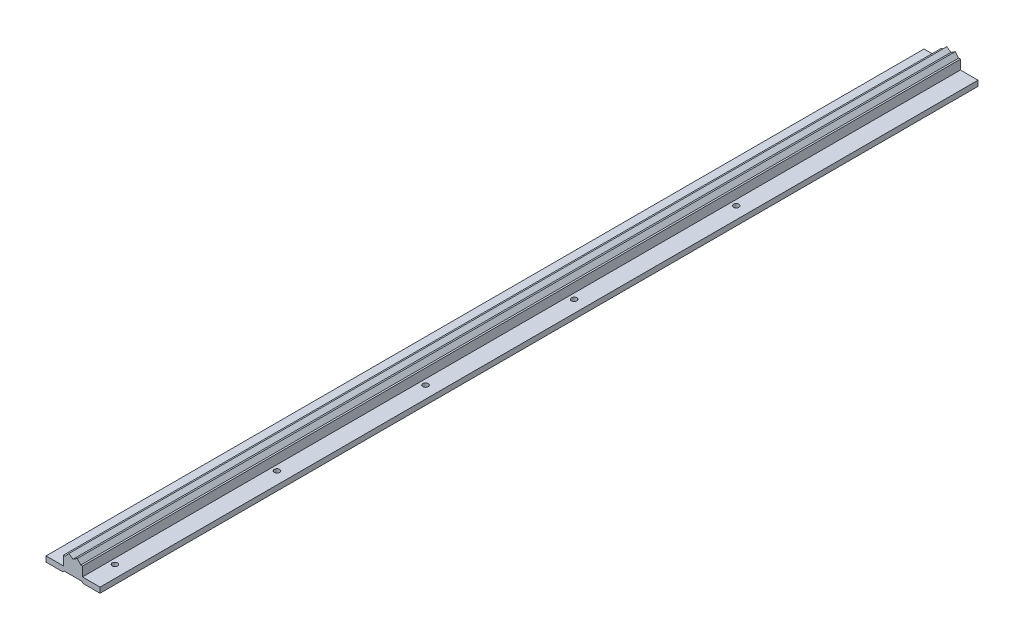
ISO-10303-21;
HEADER;
FILE_DESCRIPTION(('STEP AP214'),'2;1');
FILE_NAME('part.step','',(''),(''),'','','');
FILE_SCHEMA(('AUTOMOTIVE_DESIGN { 1 0 10303 214 1 1 1 1 }'));
ENDSEC;
DATA;
#1=APPLICATION_CONTEXT('core data for automotive mechanical design processes');
#2=APPLICATION_PROTOCOL_DEFINITION('international standard','automotive_design',2000,#1);
#3=PRODUCT_CONTEXT('',#1,'mechanical');
#4=PRODUCT('Part','Part','',(#3));
#5=PRODUCT_RELATED_PRODUCT_CATEGORY('part','',(#4));
#6=PRODUCT_DEFINITION_FORMATION('','',#4);
#7=PRODUCT_DEFINITION_CONTEXT('part definition',#1,'design');
#8=PRODUCT_DEFINITION('design','',#6,#7);
#9=PRODUCT_DEFINITION_SHAPE('','',#8);
#10=(LENGTH_UNIT() NAMED_UNIT(*) SI_UNIT(.MILLI.,.METRE.));
#11=(NAMED_UNIT(*) PLANE_ANGLE_UNIT() SI_UNIT($,.RADIAN.));
#12=(NAMED_UNIT(*) SI_UNIT($,.STERADIAN.) SOLID_ANGLE_UNIT());
#13=UNCERTAINTY_MEASURE_WITH_UNIT(LENGTH_MEASURE(1.E-05),#10,'distance_accuracy_value','');
#14=(GEOMETRIC_REPRESENTATION_CONTEXT(3) GLOBAL_UNCERTAINTY_ASSIGNED_CONTEXT((#13)) GLOBAL_UNIT_ASSIGNED_CONTEXT((#10,
#11,#12)) REPRESENTATION_CONTEXT('',''));
#15=CARTESIAN_POINT('',(0.,0.,0.));
#16=DIRECTION('',(0.,0.,1.));
#17=DIRECTION('',(1.,0.,0.));
#18=AXIS2_PLACEMENT_3D('',#15,#16,#17);
#19=CARTESIAN_POINT('',(11.,-19.0020156909,360.));
#20=DIRECTION('',(0.,1.,0.));
#21=DIRECTION('',(0.,0.,1.));
#22=AXIS2_PLACEMENT_3D('',#19,#20,#21);
#23=CYLINDRICAL_SURFACE('',#22,2.);
#24=CARTESIAN_POINT('',(11.,-15.0020156909,360.));
#25=DIRECTION('',(0.,1.,0.));
#26=DIRECTION('',(0.,0.,1.));
#27=AXIS2_PLACEMENT_3D('',#24,#25,#26);
#28=CIRCLE('',#27,2.);
#29=CARTESIAN_POINT('',(11.,-15.0020156909,362.));
#30=VERTEX_POINT('',#29);
#31=EDGE_CURVE('E20',#30,#30,#28,.T.);
#32=ORIENTED_EDGE('',*,*,#31,.T.);
#33=EDGE_LOOP('',(#32));
#34=FACE_BOUND('',#33,.T.);
#35=CARTESIAN_POINT('',(11.,-19.0020156909,360.));
#36=DIRECTION('',(0.,1.,0.));
#37=DIRECTION('',(0.,0.,1.));
#38=AXIS2_PLACEMENT_3D('',#35,#36,#37);
#39=CIRCLE('',#38,2.);
#40=CARTESIAN_POINT('',(11.,-19.0020156909,362.));
#41=VERTEX_POINT('',#40);
#42=EDGE_CURVE('E202',#41,#41,#39,.F.);
#43=ORIENTED_EDGE('',*,*,#42,.T.);
#44=EDGE_LOOP('',(#43));
#45=FACE_BOUND('',#44,.T.);
#46=ADVANCED_FACE('F17',(#34,#45),#23,.F.);
#47=CARTESIAN_POINT('',(11.,-19.0020156909,250.));
#48=DIRECTION('',(0.,1.,0.));
#49=DIRECTION('',(0.,0.,1.));
#50=AXIS2_PLACEMENT_3D('',#47,#48,#49);
#51=CYLINDRICAL_SURFACE('',#50,2.);
#52=CARTESIAN_POINT('',(11.,-15.0020156909,250.));
#53=DIRECTION('',(0.,1.,0.));
#54=DIRECTION('',(0.,0.,1.));
#55=AXIS2_PLACEMENT_3D('',#52,#53,#54);
#56=CIRCLE('',#55,2.);
#57=CARTESIAN_POINT('',(11.,-15.0020156909,252.));
#58=VERTEX_POINT('',#57);
#59=EDGE_CURVE('E254',#58,#58,#56,.T.);
#60=ORIENTED_EDGE('',*,*,#59,.T.);
#61=EDGE_LOOP('',(#60));
#62=FACE_BOUND('',#61,.T.);
#63=CARTESIAN_POINT('',(11.,-19.0020156909,250.));
#64=DIRECTION('',(0.,1.,0.));
#65=DIRECTION('',(0.,0.,1.));
#66=AXIS2_PLACEMENT_3D('',#63,#64,#65);
#67=CIRCLE('',#66,2.);
#68=CARTESIAN_POINT('',(11.,-19.0020156909,252.));
#69=VERTEX_POINT('',#68);
#70=EDGE_CURVE('E242',#69,#69,#67,.F.);
#71=ORIENTED_EDGE('',*,*,#70,.T.);
#72=EDGE_LOOP('',(#71));
#73=FACE_BOUND('',#72,.T.);
#74=ADVANCED_FACE('F355',(#62,#73),#51,.F.);
#75=CARTESIAN_POINT('',(11.,-19.0020156909,480.));
#76=DIRECTION('',(0.,1.,0.));
#77=DIRECTION('',(0.,0.,1.));
#78=AXIS2_PLACEMENT_3D('',#75,#76,#77);
#79=CYLINDRICAL_SURFACE('',#78,2.);
#80=CARTESIAN_POINT('',(11.,-15.0020156909,480.));
#81=DIRECTION('',(0.,1.,0.));
#82=DIRECTION('',(0.,0.,1.));
#83=AXIS2_PLACEMENT_3D('',#80,#81,#82);
#84=CIRCLE('',#83,2.);
#85=CARTESIAN_POINT('',(11.,-15.0020156909,482.));
#86=VERTEX_POINT('',#85);
#87=EDGE_CURVE('E252',#86,#86,#84,.T.);
#88=ORIENTED_EDGE('',*,*,#87,.T.);
#89=EDGE_LOOP('',(#88));
#90=FACE_BOUND('',#89,.T.);
#91=CARTESIAN_POINT('',(11.,-19.0020156909,480.));
#92=DIRECTION('',(0.,1.,0.));
#93=DIRECTION('',(0.,0.,1.));
#94=AXIS2_PLACEMENT_3D('',#91,#92,#93);
#95=CIRCLE('',#94,2.);
#96=CARTESIAN_POINT('',(11.,-19.0020156909,482.));
#97=VERTEX_POINT('',#96);
#98=EDGE_CURVE('E239',#97,#97,#95,.F.);
#99=ORIENTED_EDGE('',*,*,#98,.T.);
#100=EDGE_LOOP('',(#99));
#101=FACE_BOUND('',#100,.T.);
#102=ADVANCED_FACE('F359',(#90,#101),#79,.F.);
#103=CARTESIAN_POINT('',(11.,-19.0020156909,140.));
#104=DIRECTION('',(0.,1.,0.));
#105=DIRECTION('',(0.,0.,1.));
#106=AXIS2_PLACEMENT_3D('',#103,#104,#105);
#107=CYLINDRICAL_SURFACE('',#106,2.);
#108=CARTESIAN_POINT('',(11.,-15.0020156909,140.));
#109=DIRECTION('',(0.,1.,0.));
#110=DIRECTION('',(0.,0.,1.));
#111=AXIS2_PLACEMENT_3D('',#108,#109,#110);
#112=CIRCLE('',#111,2.);
#113=CARTESIAN_POINT('',(11.,-15.0020156909,142.));
#114=VERTEX_POINT('',#113);
#115=EDGE_CURVE('E249',#114,#114,#112,.T.);
#116=ORIENTED_EDGE('',*,*,#115,.T.);
#117=EDGE_LOOP('',(#116));
#118=FACE_BOUND('',#117,.T.);
#119=CARTESIAN_POINT('',(11.,-19.0020156909,140.));
#120=DIRECTION('',(0.,1.,0.));
#121=DIRECTION('',(0.,0.,1.));
#122=AXIS2_PLACEMENT_3D('',#119,#120,#121);
#123=CIRCLE('',#122,2.);
#124=CARTESIAN_POINT('',(11.,-19.0020156909,142.));
#125=VERTEX_POINT('',#124);
#126=EDGE_CURVE('E236',#125,#125,#123,.F.);
#127=ORIENTED_EDGE('',*,*,#126,.T.);
#128=EDGE_LOOP('',(#127));
#129=FACE_BOUND('',#128,.T.);
#130=ADVANCED_FACE('F363',(#118,#129),#107,.F.);
#131=CARTESIAN_POINT('',(11.,-19.0020156909,20.));
#132=DIRECTION('',(0.,1.,0.));
#133=DIRECTION('',(0.,0.,1.));
#134=AXIS2_PLACEMENT_3D('',#131,#132,#133);
#135=CYLINDRICAL_SURFACE('',#134,2.);
#136=CARTESIAN_POINT('',(11.,-15.0020156909,20.));
#137=DIRECTION('',(0.,1.,0.));
#138=DIRECTION('',(0.,0.,1.));
#139=AXIS2_PLACEMENT_3D('',#136,#137,#138);
#140=CIRCLE('',#139,2.);
#141=CARTESIAN_POINT('',(11.,-15.0020156909,22.));
#142=VERTEX_POINT('',#141);
#143=EDGE_CURVE('E203',#142,#142,#140,.T.);
#144=ORIENTED_EDGE('',*,*,#143,.T.);
#145=EDGE_LOOP('',(#144));
#146=FACE_BOUND('',#145,.T.);
#147=CARTESIAN_POINT('',(11.,-19.0020156909,20.));
#148=DIRECTION('',(0.,1.,0.));
#149=DIRECTION('',(0.,0.,1.));
#150=AXIS2_PLACEMENT_3D('',#147,#148,#149);
#151=CIRCLE('',#150,2.);
#152=CARTESIAN_POINT('',(11.,-19.0020156909,22.));
#153=VERTEX_POINT('',#152);
#154=EDGE_CURVE('E198',#153,#153,#151,.F.);
#155=ORIENTED_EDGE('',*,*,#154,.T.);
#156=EDGE_LOOP('',(#155));
#157=FACE_BOUND('',#156,.T.);
#158=ADVANCED_FACE('F370',(#146,#157),#135,.F.);
#159=CARTESIAN_POINT('',(-6.999999999999,-8.002015690898,500.));
#160=DIRECTION('',(0.,-1.,0.));
#161=DIRECTION('',(0.,0.,-1.));
#162=AXIS2_PLACEMENT_3D('',#159,#160,#161);
#163=PLANE('',#162);
#164=DIRECTION('',(1.,0.,0.));
#165=VECTOR('',#164,1.);
#166=CARTESIAN_POINT('',(-6.999999999999,-8.002015690898,-150.));
#167=LINE('',#166,#165);
#168=CARTESIAN_POINT('',(-6.999999999999,-8.002015690898,-150.));
#169=VERTEX_POINT('',#168);
#170=CARTESIAN_POINT('',(-5.72008182559,-8.002015690898,-150.));
#171=VERTEX_POINT('',#170);
#172=EDGE_CURVE('E153',#169,#171,#167,.T.);
#173=ORIENTED_EDGE('',*,*,#172,.F.);
#174=DIRECTION('',(0.,0.,-1.));
#175=VECTOR('',#174,1.);
#176=CARTESIAN_POINT('',(-6.999999999999,-8.002015690898,500.));
#177=LINE('',#176,#175);
#178=CARTESIAN_POINT('',(-6.999999999999,-8.002015690898,500.));
#179=VERTEX_POINT('',#178);
#180=EDGE_CURVE('E184',#169,#179,#177,.F.);
#181=ORIENTED_EDGE('',*,*,#180,.T.);
#182=DIRECTION('',(1.,0.,0.));
#183=VECTOR('',#182,1.);
#184=CARTESIAN_POINT('',(-6.999999999999,-8.002015690898,500.));
#185=LINE('',#184,#183);
#186=CARTESIAN_POINT('',(-5.72008182559,-8.002015690898,500.));
#187=VERTEX_POINT('',#186);
#188=EDGE_CURVE('E206',#187,#179,#185,.F.);
#189=ORIENTED_EDGE('',*,*,#188,.F.);
#190=DIRECTION('',(0.,0.,1.));
#191=VECTOR('',#190,1.);
#192=CARTESIAN_POINT('',(-5.72008182559,-8.002015690898,500.));
#193=LINE('',#192,#191);
#194=EDGE_CURVE('E181',#187,#171,#193,.F.);
#195=ORIENTED_EDGE('',*,*,#194,.T.);
#196=EDGE_LOOP('',(#173,#181,#189,#195));
#197=FACE_BOUND('',#196,.T.);
#198=ADVANCED_FACE('F374',(#197),#163,.F.);
#199=CARTESIAN_POINT('',(7.,-8.002015690899,500.));
#200=DIRECTION('',(0.,-1.,0.));
#201=DIRECTION('',(0.,0.,-1.));
#202=AXIS2_PLACEMENT_3D('',#199,#200,#201);
#203=PLANE('',#202);
#204=DIRECTION('',(1.,0.,0.));
#205=VECTOR('',#204,1.);
#206=CARTESIAN_POINT('',(7.,-8.002015690899,-150.));
#207=LINE('',#206,#205);
#208=CARTESIAN_POINT('',(5.720081825592,-8.002015690899,-150.));
#209=VERTEX_POINT('',#208);
#210=CARTESIAN_POINT('',(7.,-8.002015690899,-150.));
#211=VERTEX_POINT('',#210);
#212=EDGE_CURVE('E152',#209,#211,#207,.T.);
#213=ORIENTED_EDGE('',*,*,#212,.F.);
#214=DIRECTION('',(0.,0.,1.));
#215=VECTOR('',#214,1.);
#216=CARTESIAN_POINT('',(5.720081825592,-8.002015690899,500.));
#217=LINE('',#216,#215);
#218=CARTESIAN_POINT('',(5.720081825592,-8.002015690899,500.));
#219=VERTEX_POINT('',#218);
#220=EDGE_CURVE('E156',#209,#219,#217,.T.);
#221=ORIENTED_EDGE('',*,*,#220,.T.);
#222=DIRECTION('',(1.,0.,0.));
#223=VECTOR('',#222,1.);
#224=CARTESIAN_POINT('',(7.,-8.002015690899,500.));
#225=LINE('',#224,#223);
#226=CARTESIAN_POINT('',(7.,-8.002015690899,500.));
#227=VERTEX_POINT('',#226);
#228=EDGE_CURVE('E139',#227,#219,#225,.F.);
#229=ORIENTED_EDGE('',*,*,#228,.F.);
#230=DIRECTION('',(0.,0.,1.));
#231=VECTOR('',#230,1.);
#232=CARTESIAN_POINT('',(7.,-8.002015690899,500.));
#233=LINE('',#232,#231);
#234=EDGE_CURVE('E159',#227,#211,#233,.F.);
#235=ORIENTED_EDGE('',*,*,#234,.T.);
#236=EDGE_LOOP('',(#213,#221,#229,#235));
#237=FACE_BOUND('',#236,.T.);
#238=ADVANCED_FACE('F157',(#237),#203,.F.);
#239=CARTESIAN_POINT('',(-11.,-19.0020156909,360.));
#240=DIRECTION('',(0.,1.,0.));
#241=DIRECTION('',(0.,0.,1.));
#242=AXIS2_PLACEMENT_3D('',#239,#240,#241);
#243=CYLINDRICAL_SURFACE('',#242,2.);
#244=CARTESIAN_POINT('',(-11.,-15.0020156909,360.));
#245=DIRECTION('',(0.,1.,0.));
#246=DIRECTION('',(0.,0.,1.));
#247=AXIS2_PLACEMENT_3D('',#244,#245,#246);
#248=CIRCLE('',#247,2.);
#249=CARTESIAN_POINT('',(-11.,-15.0020156909,362.));
#250=VERTEX_POINT('',#249);
#251=EDGE_CURVE('E197',#250,#250,#248,.T.);
#252=ORIENTED_EDGE('',*,*,#251,.T.);
#253=EDGE_LOOP('',(#252));
#254=FACE_BOUND('',#253,.T.);
#255=CARTESIAN_POINT('',(-11.,-19.0020156909,360.));
#256=DIRECTION('',(0.,1.,0.));
#257=DIRECTION('',(0.,0.,1.));
#258=AXIS2_PLACEMENT_3D('',#255,#256,#257);
#259=CIRCLE('',#258,2.);
#260=CARTESIAN_POINT('',(-11.,-19.0020156909,362.));
#261=VERTEX_POINT('',#260);
#262=EDGE_CURVE('E172',#261,#261,#259,.F.);
#263=ORIENTED_EDGE('',*,*,#262,.T.);
#264=EDGE_LOOP('',(#263));
#265=FACE_BOUND('',#264,.T.);
#266=ADVANCED_FACE('F381',(#254,#265),#243,.F.);
#267=CARTESIAN_POINT('',(-11.,-19.0020156909,250.));
#268=DIRECTION('',(0.,1.,0.));
#269=DIRECTION('',(0.,0.,1.));
#270=AXIS2_PLACEMENT_3D('',#267,#268,#269);
#271=CYLINDRICAL_SURFACE('',#270,2.);
#272=CARTESIAN_POINT('',(-11.,-15.0020156909,250.));
#273=DIRECTION('',(0.,1.,0.));
#274=DIRECTION('',(0.,0.,1.));
#275=AXIS2_PLACEMENT_3D('',#272,#273,#274);
#276=CIRCLE('',#275,2.);
#277=CARTESIAN_POINT('',(-11.,-15.0020156909,252.));
#278=VERTEX_POINT('',#277);
#279=EDGE_CURVE('E229',#278,#278,#276,.T.);
#280=ORIENTED_EDGE('',*,*,#279,.T.);
#281=EDGE_LOOP('',(#280));
#282=FACE_BOUND('',#281,.T.);
#283=CARTESIAN_POINT('',(-11.,-19.0020156909,250.));
#284=DIRECTION('',(0.,1.,0.));
#285=DIRECTION('',(0.,0.,1.));
#286=AXIS2_PLACEMENT_3D('',#283,#284,#285);
#287=CIRCLE('',#286,2.);
#288=CARTESIAN_POINT('',(-11.,-19.0020156909,252.));
#289=VERTEX_POINT('',#288);
#290=EDGE_CURVE('E216',#289,#289,#287,.F.);
#291=ORIENTED_EDGE('',*,*,#290,.T.);
#292=EDGE_LOOP('',(#291));
#293=FACE_BOUND('',#292,.T.);
#294=ADVANCED_FACE('F384',(#282,#293),#271,.F.);
#295=CARTESIAN_POINT('',(-11.,-19.0020156909,140.));
#296=DIRECTION('',(0.,1.,0.));
#297=DIRECTION('',(0.,0.,1.));
#298=AXIS2_PLACEMENT_3D('',#295,#296,#297);
#299=CYLINDRICAL_SURFACE('',#298,2.);
#300=CARTESIAN_POINT('',(-11.,-15.0020156909,140.));
#301=DIRECTION('',(0.,1.,0.));
#302=DIRECTION('',(0.,0.,1.));
#303=AXIS2_PLACEMENT_3D('',#300,#301,#302);
#304=CIRCLE('',#303,2.);
#305=CARTESIAN_POINT('',(-11.,-15.0020156909,142.));
#306=VERTEX_POINT('',#305);
#307=EDGE_CURVE('E226',#306,#306,#304,.T.);
#308=ORIENTED_EDGE('',*,*,#307,.T.);
#309=EDGE_LOOP('',(#308));
#310=FACE_BOUND('',#309,.T.);
#311=CARTESIAN_POINT('',(-11.,-19.0020156909,140.));
#312=DIRECTION('',(0.,1.,0.));
#313=DIRECTION('',(0.,0.,1.));
#314=AXIS2_PLACEMENT_3D('',#311,#312,#313);
#315=CIRCLE('',#314,2.);
#316=CARTESIAN_POINT('',(-11.,-19.0020156909,142.));
#317=VERTEX_POINT('',#316);
#318=EDGE_CURVE('E213',#317,#317,#315,.F.);
#319=ORIENTED_EDGE('',*,*,#318,.T.);
#320=EDGE_LOOP('',(#319));
#321=FACE_BOUND('',#320,.T.);
#322=ADVANCED_FACE('F388',(#310,#321),#299,.F.);
#323=CARTESIAN_POINT('',(-11.,-19.0020156909,20.));
#324=DIRECTION('',(0.,1.,0.));
#325=DIRECTION('',(0.,0.,1.));
#326=AXIS2_PLACEMENT_3D('',#323,#324,#325);
#327=CYLINDRICAL_SURFACE('',#326,2.);
#328=CARTESIAN_POINT('',(-11.,-15.0020156909,20.));
#329=DIRECTION('',(0.,1.,0.));
#330=DIRECTION('',(0.,0.,1.));
#331=AXIS2_PLACEMENT_3D('',#328,#329,#330);
#332=CIRCLE('',#331,2.);
#333=CARTESIAN_POINT('',(-11.,-15.0020156909,22.));
#334=VERTEX_POINT('',#333);
#335=EDGE_CURVE('E223',#334,#334,#332,.T.);
#336=ORIENTED_EDGE('',*,*,#335,.T.);
#337=EDGE_LOOP('',(#336));
#338=FACE_BOUND('',#337,.T.);
#339=CARTESIAN_POINT('',(-11.,-19.0020156909,20.));
#340=DIRECTION('',(0.,1.,0.));
#341=DIRECTION('',(0.,0.,1.));
#342=AXIS2_PLACEMENT_3D('',#339,#340,#341);
#343=CIRCLE('',#342,2.);
#344=CARTESIAN_POINT('',(-11.,-19.0020156909,22.));
#345=VERTEX_POINT('',#344);
#346=EDGE_CURVE('E210',#345,#345,#343,.F.);
#347=ORIENTED_EDGE('',*,*,#346,.T.);
#348=EDGE_LOOP('',(#347));
#349=FACE_BOUND('',#348,.T.);
#350=ADVANCED_FACE('F277',(#338,#349),#327,.F.);
#351=CARTESIAN_POINT('',(-11.,-19.0020156909,480.));
#352=DIRECTION('',(0.,1.,0.));
#353=DIRECTION('',(0.,0.,1.));
#354=AXIS2_PLACEMENT_3D('',#351,#352,#353);
#355=CYLINDRICAL_SURFACE('',#354,2.);
#356=CARTESIAN_POINT('',(-11.,-15.0020156909,480.));
#357=DIRECTION('',(0.,1.,0.));
#358=DIRECTION('',(0.,0.,1.));
#359=AXIS2_PLACEMENT_3D('',#356,#357,#358);
#360=CIRCLE('',#359,2.);
#361=CARTESIAN_POINT('',(-11.,-15.0020156909,482.));
#362=VERTEX_POINT('',#361);
#363=EDGE_CURVE('E193',#362,#362,#360,.T.);
#364=ORIENTED_EDGE('',*,*,#363,.T.);
#365=EDGE_LOOP('',(#364));
#366=FACE_BOUND('',#365,.T.);
#367=CARTESIAN_POINT('',(-11.,-19.0020156909,480.));
#368=DIRECTION('',(0.,1.,0.));
#369=DIRECTION('',(0.,0.,1.));
#370=AXIS2_PLACEMENT_3D('',#367,#368,#369);
#371=CIRCLE('',#370,2.);
#372=CARTESIAN_POINT('',(-11.,-19.0020156909,482.));
#373=VERTEX_POINT('',#372);
#374=EDGE_CURVE('E166',#373,#373,#371,.F.);
#375=ORIENTED_EDGE('',*,*,#374,.T.);
#376=EDGE_LOOP('',(#375));
#377=FACE_BOUND('',#376,.T.);
#378=ADVANCED_FACE('F266',(#366,#377),#355,.F.);
#379=CARTESIAN_POINT('',(20.,-15.0020156909,500.));
#380=DIRECTION('',(0.,-1.,0.));
#381=DIRECTION('',(0.,0.,-1.));
#382=AXIS2_PLACEMENT_3D('',#379,#380,#381);
#383=PLANE('',#382);
#384=DIRECTION('',(-1.,0.,0.));
#385=VECTOR('',#384,1.);
#386=CARTESIAN_POINT('',(0.,-15.0020156909,-150.));
#387=LINE('',#386,#385);
#388=CARTESIAN_POINT('',(7.,-15.0020156909,-150.));
#389=VERTEX_POINT('',#388);
#390=CARTESIAN_POINT('',(20.,-15.0020156909,-150.));
#391=VERTEX_POINT('',#390);
#392=EDGE_CURVE('E619',#389,#391,#387,.F.);
#393=ORIENTED_EDGE('',*,*,#392,.F.);
#394=DIRECTION('',(0.,0.,1.));
#395=VECTOR('',#394,1.);
#396=CARTESIAN_POINT('',(7.,-15.0020156909,500.));
#397=LINE('',#396,#395);
#398=CARTESIAN_POINT('',(7.,-15.0020156909,500.));
#399=VERTEX_POINT('',#398);
#400=EDGE_CURVE('E170',#389,#399,#397,.T.);
#401=ORIENTED_EDGE('',*,*,#400,.T.);
#402=DIRECTION('',(-1.,0.,0.));
#403=VECTOR('',#402,1.);
#404=CARTESIAN_POINT('',(-6.999999999999,-15.0020156909,500.));
#405=LINE('',#404,#403);
#406=CARTESIAN_POINT('',(20.,-15.0020156909,500.));
#407=VERTEX_POINT('',#406);
#408=EDGE_CURVE('E164',#399,#407,#405,.F.);
#409=ORIENTED_EDGE('',*,*,#408,.T.);
#410=DIRECTION('',(0.,0.,1.));
#411=VECTOR('',#410,1.);
#412=CARTESIAN_POINT('',(20.,-15.0020156909,500.));
#413=LINE('',#412,#411);
#414=EDGE_CURVE('E199',#407,#391,#413,.F.);
#415=ORIENTED_EDGE('',*,*,#414,.T.);
#416=EDGE_LOOP('',(#393,#401,#409,#415));
#417=FACE_BOUND('',#416,.T.);
#418=ORIENTED_EDGE('',*,*,#143,.F.);
#419=EDGE_LOOP('',(#418));
#420=FACE_BOUND('',#419,.T.);
#421=ORIENTED_EDGE('',*,*,#115,.F.);
#422=EDGE_LOOP('',(#421));
#423=FACE_BOUND('',#422,.T.);
#424=ORIENTED_EDGE('',*,*,#87,.F.);
#425=EDGE_LOOP('',(#424));
#426=FACE_BOUND('',#425,.T.);
#427=ORIENTED_EDGE('',*,*,#59,.F.);
#428=EDGE_LOOP('',(#427));
#429=FACE_BOUND('',#428,.T.);
#430=ORIENTED_EDGE('',*,*,#31,.F.);
#431=EDGE_LOOP('',(#430));
#432=FACE_BOUND('',#431,.T.);
#433=ADVANCED_FACE('F263',(#417,#420,#423,#426,#429,#432),#383,.F.);
#434=CARTESIAN_POINT('',(20.,-19.0020156909,500.));
#435=DIRECTION('',(-1.,0.,0.));
#436=DIRECTION('',(0.,0.,1.));
#437=AXIS2_PLACEMENT_3D('',#434,#435,#436);
#438=PLANE('',#437);
#439=DIRECTION('',(0.,1.,0.));
#440=VECTOR('',#439,1.);
#441=CARTESIAN_POINT('',(20.,0.,-150.));
#442=LINE('',#441,#440);
#443=CARTESIAN_POINT('',(20.,-19.0020156909,-150.));
#444=VERTEX_POINT('',#443);
#445=EDGE_CURVE('E617',#391,#444,#442,.F.);
#446=ORIENTED_EDGE('',*,*,#445,.F.);
#447=ORIENTED_EDGE('',*,*,#414,.F.);
#448=DIRECTION('',(0.,1.,0.));
#449=VECTOR('',#448,1.);
#450=CARTESIAN_POINT('',(20.,-8.002015690899,500.));
#451=LINE('',#450,#449);
#452=CARTESIAN_POINT('',(20.,-19.0020156909,500.));
#453=VERTEX_POINT('',#452);
#454=EDGE_CURVE('E646',#407,#453,#451,.F.);
#455=ORIENTED_EDGE('',*,*,#454,.T.);
#456=DIRECTION('',(0.,0.,1.));
#457=VECTOR('',#456,1.);
#458=CARTESIAN_POINT('',(20.,-19.0020156909,500.));
#459=LINE('',#458,#457);
#460=EDGE_CURVE('E194',#453,#444,#459,.F.);
#461=ORIENTED_EDGE('',*,*,#460,.T.);
#462=EDGE_LOOP('',(#446,#447,#455,#461));
#463=FACE_BOUND('',#462,.T.);
#464=ADVANCED_FACE('F265',(#463),#438,.F.);
#465=CARTESIAN_POINT('',(20.,-19.0020156909,500.));
#466=DIRECTION('',(0.,1.,0.));
#467=DIRECTION('',(0.,0.,1.));
#468=AXIS2_PLACEMENT_3D('',#465,#466,#467);
#469=PLANE('',#468);
#470=DIRECTION('',(-1.,0.,0.));
#471=VECTOR('',#470,1.);
#472=CARTESIAN_POINT('',(0.,-19.0020156909,-150.));
#473=LINE('',#472,#471);
#474=CARTESIAN_POINT('',(7.500000000001,-19.0020156909,-150.));
#475=VERTEX_POINT('',#474);
#476=EDGE_CURVE('E344',#444,#475,#473,.T.);
#477=ORIENTED_EDGE('',*,*,#476,.F.);
#478=ORIENTED_EDGE('',*,*,#460,.F.);
#479=DIRECTION('',(-1.,0.,0.));
#480=VECTOR('',#479,1.);
#481=CARTESIAN_POINT('',(-6.999999999999,-19.0020156909,500.));
#482=LINE('',#481,#480);
#483=CARTESIAN_POINT('',(7.500000000001,-19.0020156909,500.));
#484=VERTEX_POINT('',#483);
#485=EDGE_CURVE('E644',#453,#484,#482,.T.);
#486=ORIENTED_EDGE('',*,*,#485,.T.);
#487=DIRECTION('',(0.,0.,1.));
#488=VECTOR('',#487,1.);
#489=CARTESIAN_POINT('',(7.500000000001,-19.0020156909,500.));
#490=LINE('',#489,#488);
#491=EDGE_CURVE('E621',#484,#475,#490,.F.);
#492=ORIENTED_EDGE('',*,*,#491,.T.);
#493=EDGE_LOOP('',(#477,#478,#486,#492));
#494=FACE_BOUND('',#493,.T.);
#495=ORIENTED_EDGE('',*,*,#154,.F.);
#496=EDGE_LOOP('',(#495));
#497=FACE_BOUND('',#496,.T.);
#498=ORIENTED_EDGE('',*,*,#126,.F.);
#499=EDGE_LOOP('',(#498));
#500=FACE_BOUND('',#499,.T.);
#501=ORIENTED_EDGE('',*,*,#98,.F.);
#502=EDGE_LOOP('',(#501));
#503=FACE_BOUND('',#502,.T.);
#504=ORIENTED_EDGE('',*,*,#70,.F.);
#505=EDGE_LOOP('',(#504));
#506=FACE_BOUND('',#505,.T.);
#507=ORIENTED_EDGE('',*,*,#42,.F.);
#508=EDGE_LOOP('',(#507));
#509=FACE_BOUND('',#508,.T.);
#510=ADVANCED_FACE('F274',(#494,#497,#500,#503,#506,#509),#469,.F.);
#511=CARTESIAN_POINT('',(-20.,-19.0020156909,500.));
#512=DIRECTION('',(1.,0.,0.));
#513=DIRECTION('',(0.,0.,-1.));
#514=AXIS2_PLACEMENT_3D('',#511,#512,#513);
#515=PLANE('',#514);
#516=DIRECTION('',(0.,1.,0.));
#517=VECTOR('',#516,1.);
#518=CARTESIAN_POINT('',(-20.,0.,-150.));
#519=LINE('',#518,#517);
#520=CARTESIAN_POINT('',(-20.,-19.0020156909,-150.));
#521=VERTEX_POINT('',#520);
#522=CARTESIAN_POINT('',(-20.,-15.0020156909,-150.));
#523=VERTEX_POINT('',#522);
#524=EDGE_CURVE('E606',#521,#523,#519,.T.);
#525=ORIENTED_EDGE('',*,*,#524,.F.);
#526=DIRECTION('',(0.,0.,1.));
#527=VECTOR('',#526,1.);
#528=CARTESIAN_POINT('',(-20.,-19.0020156909,500.));
#529=LINE('',#528,#527);
#530=CARTESIAN_POINT('',(-20.,-19.0020156909,500.));
#531=VERTEX_POINT('',#530);
#532=EDGE_CURVE('E162',#521,#531,#529,.T.);
#533=ORIENTED_EDGE('',*,*,#532,.T.);
#534=DIRECTION('',(0.,1.,0.));
#535=VECTOR('',#534,1.);
#536=CARTESIAN_POINT('',(-20.,-8.002015690899,500.));
#537=LINE('',#536,#535);
#538=CARTESIAN_POINT('',(-20.,-15.0020156909,500.));
#539=VERTEX_POINT('',#538);
#540=EDGE_CURVE('E638',#531,#539,#537,.T.);
#541=ORIENTED_EDGE('',*,*,#540,.T.);
#542=DIRECTION('',(0.,0.,-1.));
#543=VECTOR('',#542,1.);
#544=CARTESIAN_POINT('',(-20.,-15.0020156909,500.));
#545=LINE('',#544,#543);
#546=EDGE_CURVE('E190',#539,#523,#545,.T.);
#547=ORIENTED_EDGE('',*,*,#546,.T.);
#548=EDGE_LOOP('',(#525,#533,#541,#547));
#549=FACE_BOUND('',#548,.T.);
#550=ADVANCED_FACE('F332',(#549),#515,.F.);
#551=CARTESIAN_POINT('',(-6.999999999999,-15.0020156909,500.));
#552=DIRECTION('',(0.,-1.,0.));
#553=DIRECTION('',(0.,0.,-1.));
#554=AXIS2_PLACEMENT_3D('',#551,#552,#553);
#555=PLANE('',#554);
#556=DIRECTION('',(-1.,0.,0.));
#557=VECTOR('',#556,1.);
#558=CARTESIAN_POINT('',(0.,-15.0020156909,-150.));
#559=LINE('',#558,#557);
#560=CARTESIAN_POINT('',(-6.999999999999,-15.0020156909,-150.));
#561=VERTEX_POINT('',#560);
#562=EDGE_CURVE('E601',#523,#561,#559,.F.);
#563=ORIENTED_EDGE('',*,*,#562,.F.);
#564=ORIENTED_EDGE('',*,*,#546,.F.);
#565=DIRECTION('',(-1.,0.,0.));
#566=VECTOR('',#565,1.);
#567=CARTESIAN_POINT('',(-6.999999999999,-15.0020156909,500.));
#568=LINE('',#567,#566);
#569=CARTESIAN_POINT('',(-6.999999999999,-15.0020156909,500.));
#570=VERTEX_POINT('',#569);
#571=EDGE_CURVE('E635',#539,#570,#568,.F.);
#572=ORIENTED_EDGE('',*,*,#571,.T.);
#573=DIRECTION('',(0.,0.,-1.));
#574=VECTOR('',#573,1.);
#575=CARTESIAN_POINT('',(-6.999999999999,-15.0020156909,500.));
#576=LINE('',#575,#574);
#577=EDGE_CURVE('E187',#570,#561,#576,.T.);
#578=ORIENTED_EDGE('',*,*,#577,.T.);
#579=EDGE_LOOP('',(#563,#564,#572,#578));
#580=FACE_BOUND('',#579,.T.);
#581=ORIENTED_EDGE('',*,*,#363,.F.);
#582=EDGE_LOOP('',(#581));
#583=FACE_BOUND('',#582,.T.);
#584=ORIENTED_EDGE('',*,*,#335,.F.);
#585=EDGE_LOOP('',(#584));
#586=FACE_BOUND('',#585,.T.);
#587=ORIENTED_EDGE('',*,*,#307,.F.);
#588=EDGE_LOOP('',(#587));
#589=FACE_BOUND('',#588,.T.);
#590=ORIENTED_EDGE('',*,*,#279,.F.);
#591=EDGE_LOOP('',(#590));
#592=FACE_BOUND('',#591,.T.);
#593=ORIENTED_EDGE('',*,*,#251,.F.);
#594=EDGE_LOOP('',(#593));
#595=FACE_BOUND('',#594,.T.);
#596=ADVANCED_FACE('F328',(#580,#583,#586,#589,#592,#595),#555,.F.);
#597=CARTESIAN_POINT('',(-6.999999999999,-15.0020156909,500.));
#598=DIRECTION('',(1.,0.,0.));
#599=DIRECTION('',(0.,0.,-1.));
#600=AXIS2_PLACEMENT_3D('',#597,#598,#599);
#601=PLANE('',#600);
#602=DIRECTION('',(0.,1.,0.));
#603=VECTOR('',#602,1.);
#604=CARTESIAN_POINT('',(-6.999999999999,0.,-150.));
#605=LINE('',#604,#603);
#606=EDGE_CURVE('E597',#561,#169,#605,.T.);
#607=ORIENTED_EDGE('',*,*,#606,.F.);
#608=ORIENTED_EDGE('',*,*,#577,.F.);
#609=DIRECTION('',(0.,1.,0.));
#610=VECTOR('',#609,1.);
#611=CARTESIAN_POINT('',(-6.999999999999,-8.002015690899,500.));
#612=LINE('',#611,#610);
#613=EDGE_CURVE('E599',#570,#179,#612,.T.);
#614=ORIENTED_EDGE('',*,*,#613,.T.);
#615=ORIENTED_EDGE('',*,*,#180,.F.);
#616=EDGE_LOOP('',(#607,#608,#614,#615));
#617=FACE_BOUND('',#616,.T.);
#618=ADVANCED_FACE('F324',(#617),#601,.F.);
#619=CARTESIAN_POINT('',(-5.72008182559,-8.002015690898,500.));
#620=DIRECTION('',(0.748746223848007,-0.662856766031206,0.));
#621=DIRECTION('',(0.662856766031206,0.748746223848007,0.));
#622=AXIS2_PLACEMENT_3D('',#619,#620,#621);
#623=PLANE('',#622);
#624=DIRECTION('',(0.662856766031186,0.748746223848026,0.));
#625=VECTOR('',#624,1.);
#626=CARTESIAN_POINT('',(-5.72008182559,-8.002015690898,-150.));
#627=LINE('',#626,#625);
#628=CARTESIAN_POINT('',(-3.15440581759688,-5.1038930178741,-150.));
#629=VERTEX_POINT('',#628);
#630=EDGE_CURVE('E602',#171,#629,#627,.T.);
#631=ORIENTED_EDGE('',*,*,#630,.F.);
#632=ORIENTED_EDGE('',*,*,#194,.F.);
#633=DIRECTION('',(0.662856766031186,0.748746223848026,0.));
#634=VECTOR('',#633,1.);
#635=CARTESIAN_POINT('',(-5.72008182559,-8.002015690898,500.));
#636=LINE('',#635,#634);
#637=CARTESIAN_POINT('',(-3.15440581759688,-5.1038930178741,500.));
#638=VERTEX_POINT('',#637);
#639=EDGE_CURVE('E631',#187,#638,#636,.T.);
#640=ORIENTED_EDGE('',*,*,#639,.T.);
#641=DIRECTION('',(0.,0.,1.));
#642=VECTOR('',#641,1.);
#643=CARTESIAN_POINT('',(-3.15440581759691,-5.10389301787406,500.));
#644=LINE('',#643,#642);
#645=EDGE_CURVE('E178',#638,#629,#644,.F.);
#646=ORIENTED_EDGE('',*,*,#645,.T.);
#647=EDGE_LOOP('',(#631,#632,#640,#646));
#648=FACE_BOUND('',#647,.T.);
#649=ADVANCED_FACE('F320',(#648),#623,.F.);
#650=CARTESIAN_POINT('',(-3.154405817597,-5.103893017874,500.));
#651=DIRECTION('',(-0.540812375972124,-0.841143254146038,0.));
#652=DIRECTION('',(0.841143254146038,-0.540812375972124,0.));
#653=AXIS2_PLACEMENT_3D('',#650,#651,#652);
#654=PLANE('',#653);
#655=DIRECTION('',(0.841143254145996,-0.54081237597219,0.));
#656=VECTOR('',#655,1.);
#657=CARTESIAN_POINT('',(-3.15440581759692,-5.10389301787407,-150.));
#658=LINE('',#657,#656);
#659=CARTESIAN_POINT('',(4.48383358062232E-13,-7.13201569089868,-150.));
#660=VERTEX_POINT('',#659);
#661=EDGE_CURVE('E604',#629,#660,#658,.T.);
#662=ORIENTED_EDGE('',*,*,#661,.F.);
#663=ORIENTED_EDGE('',*,*,#645,.F.);
#664=DIRECTION('',(0.841143254145987,-0.540812375972203,0.));
#665=VECTOR('',#664,1.);
#666=CARTESIAN_POINT('',(-3.15440581759692,-5.10389301787407,500.));
#667=LINE('',#666,#665);
#668=CARTESIAN_POINT('',(4.22066751898029E-13,-7.13201569089868,500.));
#669=VERTEX_POINT('',#668);
#670=EDGE_CURVE('E628',#638,#669,#667,.T.);
#671=ORIENTED_EDGE('',*,*,#670,.T.);
#672=DIRECTION('',(0.,0.,1.));
#673=VECTOR('',#672,1.);
#674=CARTESIAN_POINT('',(2.96475470597113E-13,-7.13201569089883,500.));
#675=LINE('',#674,#673);
#676=EDGE_CURVE('E175',#669,#660,#675,.F.);
#677=ORIENTED_EDGE('',*,*,#676,.T.);
#678=EDGE_LOOP('',(#662,#663,#671,#677));
#679=FACE_BOUND('',#678,.T.);
#680=ADVANCED_FACE('F316',(#679),#654,.F.);
#681=CARTESIAN_POINT('',(0.,-7.132015690899,500.));
#682=DIRECTION('',(0.540812375972124,-0.841143254146038,0.));
#683=DIRECTION('',(0.841143254146038,0.540812375972124,0.));
#684=AXIS2_PLACEMENT_3D('',#681,#682,#683);
#685=PLANE('',#684);
#686=DIRECTION('',(0.841143254145984,0.540812375972207,0.));
#687=VECTOR('',#686,1.);
#688=CARTESIAN_POINT('',(3.87652781505947E-13,-7.1320156908988,-150.));
#689=LINE('',#688,#687);
#690=CARTESIAN_POINT('',(3.15440581759722,-5.10389301787449,-150.));
#691=VERTEX_POINT('',#690);
#692=EDGE_CURVE('E660',#660,#691,#689,.T.);
#693=ORIENTED_EDGE('',*,*,#692,.F.);
#694=ORIENTED_EDGE('',*,*,#676,.F.);
#695=DIRECTION('',(0.841143254145992,0.540812375972195,0.));
#696=VECTOR('',#695,1.);
#697=CARTESIAN_POINT('',(2.81892564846231E-13,-7.1320156908988,500.));
#698=LINE('',#697,#696);
#699=CARTESIAN_POINT('',(3.15440581759715,-5.10389301787444,500.));
#700=VERTEX_POINT('',#699);
#701=EDGE_CURVE('E626',#669,#700,#698,.T.);
#702=ORIENTED_EDGE('',*,*,#701,.T.);
#703=DIRECTION('',(0.,0.,1.));
#704=VECTOR('',#703,1.);
#705=CARTESIAN_POINT('',(3.15440581759707,-5.1038930178744,500.));
#706=LINE('',#705,#704);
#707=EDGE_CURVE('E134',#700,#691,#706,.F.);
#708=ORIENTED_EDGE('',*,*,#707,.T.);
#709=EDGE_LOOP('',(#693,#694,#702,#708));
#710=FACE_BOUND('',#709,.T.);
#711=ADVANCED_FACE('F313',(#710),#685,.F.);
#712=CARTESIAN_POINT('',(5.720081825592,-8.002015690899,500.));
#713=DIRECTION('',(-0.748746223847864,-0.662856766031368,0.));
#714=DIRECTION('',(0.662856766031368,-0.748746223847864,0.));
#715=AXIS2_PLACEMENT_3D('',#712,#713,#714);
#716=PLANE('',#715);
#717=DIRECTION('',(0.662856766031347,-0.748746223847883,0.));
#718=VECTOR('',#717,1.);
#719=CARTESIAN_POINT('',(3.15440581759715,-5.10389301787433,-150.));
#720=LINE('',#719,#718);
#721=EDGE_CURVE('E656',#691,#209,#720,.T.);
#722=ORIENTED_EDGE('',*,*,#721,.F.);
#723=ORIENTED_EDGE('',*,*,#707,.F.);
#724=DIRECTION('',(0.662856766031347,-0.748746223847883,0.));
#725=VECTOR('',#724,1.);
#726=CARTESIAN_POINT('',(3.15440581759715,-5.10389301787433,500.));
#727=LINE('',#726,#725);
#728=EDGE_CURVE('E144',#700,#219,#727,.T.);
#729=ORIENTED_EDGE('',*,*,#728,.T.);
#730=ORIENTED_EDGE('',*,*,#220,.F.);
#731=EDGE_LOOP('',(#722,#723,#729,#730));
#732=FACE_BOUND('',#731,.T.);
#733=ADVANCED_FACE('F161',(#732),#716,.F.);
#734=CARTESIAN_POINT('',(7.,-15.0020156909,500.));
#735=DIRECTION('',(-1.,0.,0.));
#736=DIRECTION('',(0.,0.,1.));
#737=AXIS2_PLACEMENT_3D('',#734,#735,#736);
#738=PLANE('',#737);
#739=DIRECTION('',(0.,1.,0.));
#740=VECTOR('',#739,1.);
#741=CARTESIAN_POINT('',(7.,0.,-150.));
#742=LINE('',#741,#740);
#743=EDGE_CURVE('E654',#211,#389,#742,.F.);
#744=ORIENTED_EDGE('',*,*,#743,.F.);
#745=ORIENTED_EDGE('',*,*,#234,.F.);
#746=DIRECTION('',(0.,1.,0.));
#747=VECTOR('',#746,1.);
#748=CARTESIAN_POINT('',(7.,-8.002015690899,500.));
#749=LINE('',#748,#747);
#750=EDGE_CURVE('E148',#227,#399,#749,.F.);
#751=ORIENTED_EDGE('',*,*,#750,.T.);
#752=ORIENTED_EDGE('',*,*,#400,.F.);
#753=EDGE_LOOP('',(#744,#745,#751,#752));
#754=FACE_BOUND('',#753,.T.);
#755=ADVANCED_FACE('F306',(#754),#738,.F.);
#756=CARTESIAN_POINT('',(-7.499999999999,-19.0020156909,500.));
#757=DIRECTION('',(0.,1.,0.));
#758=DIRECTION('',(0.,0.,1.));
#759=AXIS2_PLACEMENT_3D('',#756,#757,#758);
#760=PLANE('',#759);
#761=DIRECTION('',(-1.,0.,0.));
#762=VECTOR('',#761,1.);
#763=CARTESIAN_POINT('',(0.,-19.0020156909,-150.));
#764=LINE('',#763,#762);
#765=CARTESIAN_POINT('',(-7.499999999999,-19.0020156909,-150.));
#766=VERTEX_POINT('',#765);
#767=EDGE_CURVE('E611',#766,#521,#764,.T.);
#768=ORIENTED_EDGE('',*,*,#767,.F.);
#769=DIRECTION('',(0.,0.,1.));
#770=VECTOR('',#769,1.);
#771=CARTESIAN_POINT('',(-7.499999999999,-19.0020156909,500.));
#772=LINE('',#771,#770);
#773=CARTESIAN_POINT('',(-7.499999999999,-19.0020156909,500.));
#774=VERTEX_POINT('',#773);
#775=EDGE_CURVE('E674',#766,#774,#772,.T.);
#776=ORIENTED_EDGE('',*,*,#775,.T.);
#777=DIRECTION('',(-1.,0.,0.));
#778=VECTOR('',#777,1.);
#779=CARTESIAN_POINT('',(-6.999999999999,-19.0020156909,500.));
#780=LINE('',#779,#778);
#781=EDGE_CURVE('E641',#774,#531,#780,.T.);
#782=ORIENTED_EDGE('',*,*,#781,.T.);
#783=ORIENTED_EDGE('',*,*,#532,.F.);
#784=EDGE_LOOP('',(#768,#776,#782,#783));
#785=FACE_BOUND('',#784,.T.);
#786=ORIENTED_EDGE('',*,*,#374,.F.);
#787=EDGE_LOOP('',(#786));
#788=FACE_BOUND('',#787,.T.);
#789=ORIENTED_EDGE('',*,*,#346,.F.);
#790=EDGE_LOOP('',(#789));
#791=FACE_BOUND('',#790,.T.);
#792=ORIENTED_EDGE('',*,*,#318,.F.);
#793=EDGE_LOOP('',(#792));
#794=FACE_BOUND('',#793,.T.);
#795=ORIENTED_EDGE('',*,*,#290,.F.);
#796=EDGE_LOOP('',(#795));
#797=FACE_BOUND('',#796,.T.);
#798=ORIENTED_EDGE('',*,*,#262,.F.);
#799=EDGE_LOOP('',(#798));
#800=FACE_BOUND('',#799,.T.);
#801=ADVANCED_FACE('F303',(#785,#788,#791,#794,#797,#800),#760,.F.);
#802=CARTESIAN_POINT('',(-6.999999999999,-8.002015690899,500.));
#803=DIRECTION('',(0.,0.,-1.));
#804=DIRECTION('',(-1.,0.,0.));
#805=AXIS2_PLACEMENT_3D('',#802,#803,#804);
#806=PLANE('',#805);
#807=ORIENTED_EDGE('',*,*,#670,.F.);
#808=ORIENTED_EDGE('',*,*,#639,.F.);
#809=ORIENTED_EDGE('',*,*,#188,.T.);
#810=ORIENTED_EDGE('',*,*,#613,.F.);
#811=ORIENTED_EDGE('',*,*,#571,.F.);
#812=ORIENTED_EDGE('',*,*,#540,.F.);
#813=ORIENTED_EDGE('',*,*,#781,.F.);
#814=DIRECTION('',(-0.707106781186548,-0.707106781186548,0.));
#815=VECTOR('',#814,1.);
#816=CARTESIAN_POINT('',(-7.499999999999,-19.0020156909,500.));
#817=LINE('',#816,#815);
#818=CARTESIAN_POINT('',(-6.499999999999,-18.0020156909,500.));
#819=VERTEX_POINT('',#818);
#820=EDGE_CURVE('E655',#774,#819,#817,.F.);
#821=ORIENTED_EDGE('',*,*,#820,.T.);
#822=DIRECTION('',(1.,0.,0.));
#823=VECTOR('',#822,1.);
#824=CARTESIAN_POINT('',(6.500000000001,-18.0020156909,500.));
#825=LINE('',#824,#823);
#826=CARTESIAN_POINT('',(6.500000000001,-18.0020156909,500.));
#827=VERTEX_POINT('',#826);
#828=EDGE_CURVE('E675',#819,#827,#825,.T.);
#829=ORIENTED_EDGE('',*,*,#828,.T.);
#830=DIRECTION('',(-0.707106781186548,0.707106781186548,0.));
#831=VECTOR('',#830,1.);
#832=CARTESIAN_POINT('',(7.500000000001,-19.0020156909,500.));
#833=LINE('',#832,#831);
#834=EDGE_CURVE('E623',#827,#484,#833,.F.);
#835=ORIENTED_EDGE('',*,*,#834,.T.);
#836=ORIENTED_EDGE('',*,*,#485,.F.);
#837=ORIENTED_EDGE('',*,*,#454,.F.);
#838=ORIENTED_EDGE('',*,*,#408,.F.);
#839=ORIENTED_EDGE('',*,*,#750,.F.);
#840=ORIENTED_EDGE('',*,*,#228,.T.);
#841=ORIENTED_EDGE('',*,*,#728,.F.);
#842=ORIENTED_EDGE('',*,*,#701,.F.);
#843=EDGE_LOOP('',(#807,#808,#809,#810,#811,#812,#813,#821,#829,#835,#836,#837,#838,#839,#840,
#841,#842));
#844=FACE_BOUND('',#843,.T.);
#845=ADVANCED_FACE('F142',(#844),#806,.F.);
#846=CARTESIAN_POINT('',(7.500000000001,-19.0020156909,500.));
#847=DIRECTION('',(0.707106781186548,0.707106781186548,0.));
#848=DIRECTION('',(-0.707106781186548,0.707106781186548,0.));
#849=AXIS2_PLACEMENT_3D('',#846,#847,#848);
#850=PLANE('',#849);
#851=DIRECTION('',(-0.707106781186549,0.707106781186546,0.));
#852=VECTOR('',#851,1.);
#853=CARTESIAN_POINT('',(7.500000000001,-19.0020156909,-150.));
#854=LINE('',#853,#852);
#855=CARTESIAN_POINT('',(6.500000000001,-18.0020156909,-150.));
#856=VERTEX_POINT('',#855);
#857=EDGE_CURVE('E614',#475,#856,#854,.T.);
#858=ORIENTED_EDGE('',*,*,#857,.F.);
#859=ORIENTED_EDGE('',*,*,#491,.F.);
#860=ORIENTED_EDGE('',*,*,#834,.F.);
#861=DIRECTION('',(0.,0.,1.));
#862=VECTOR('',#861,1.);
#863=CARTESIAN_POINT('',(6.500000000001,-18.0020156909,500.));
#864=LINE('',#863,#862);
#865=EDGE_CURVE('E678',#827,#856,#864,.F.);
#866=ORIENTED_EDGE('',*,*,#865,.T.);
#867=EDGE_LOOP('',(#858,#859,#860,#866));
#868=FACE_BOUND('',#867,.T.);
#869=ADVANCED_FACE('F296',(#868),#850,.F.);
#870=CARTESIAN_POINT('',(0.,0.,-150.));
#871=DIRECTION('',(0.,0.,-1.));
#872=DIRECTION('',(-1.,0.,0.));
#873=AXIS2_PLACEMENT_3D('',#870,#871,#872);
#874=PLANE('',#873);
#875=ORIENTED_EDGE('',*,*,#212,.T.);
#876=ORIENTED_EDGE('',*,*,#743,.T.);
#877=ORIENTED_EDGE('',*,*,#392,.T.);
#878=ORIENTED_EDGE('',*,*,#445,.T.);
#879=ORIENTED_EDGE('',*,*,#476,.T.);
#880=ORIENTED_EDGE('',*,*,#857,.T.);
#881=DIRECTION('',(1.,0.,0.));
#882=VECTOR('',#881,1.);
#883=CARTESIAN_POINT('',(6.500000000001,-18.0020156909,-150.));
#884=LINE('',#883,#882);
#885=CARTESIAN_POINT('',(-6.499999999999,-18.0020156909,-150.));
#886=VERTEX_POINT('',#885);
#887=EDGE_CURVE('E26',#856,#886,#884,.F.);
#888=ORIENTED_EDGE('',*,*,#887,.T.);
#889=DIRECTION('',(-0.707106781186548,-0.707106781186548,0.));
#890=VECTOR('',#889,1.);
#891=CARTESIAN_POINT('',(-7.499999999999,-19.0020156909,-150.));
#892=LINE('',#891,#890);
#893=EDGE_CURVE('E34',#886,#766,#892,.T.);
#894=ORIENTED_EDGE('',*,*,#893,.T.);
#895=ORIENTED_EDGE('',*,*,#767,.T.);
#896=ORIENTED_EDGE('',*,*,#524,.T.);
#897=ORIENTED_EDGE('',*,*,#562,.T.);
#898=ORIENTED_EDGE('',*,*,#606,.T.);
#899=ORIENTED_EDGE('',*,*,#172,.T.);
#900=ORIENTED_EDGE('',*,*,#630,.T.);
#901=ORIENTED_EDGE('',*,*,#661,.T.);
#902=ORIENTED_EDGE('',*,*,#692,.T.);
#903=ORIENTED_EDGE('',*,*,#721,.T.);
#904=EDGE_LOOP('',(#875,#876,#877,#878,#879,#880,#888,#894,#895,#896,#897,#898,#899,#900,#901,
#902,#903));
#905=FACE_BOUND('',#904,.T.);
#906=ADVANCED_FACE('F290',(#905),#874,.T.);
#907=CARTESIAN_POINT('',(-7.499999999999,-19.0020156909,500.));
#908=DIRECTION('',(-0.707106781186548,0.707106781186548,0.));
#909=DIRECTION('',(-0.707106781186548,-0.707106781186548,0.));
#910=AXIS2_PLACEMENT_3D('',#907,#908,#909);
#911=PLANE('',#910);
#912=ORIENTED_EDGE('',*,*,#893,.F.);
#913=DIRECTION('',(0.,0.,1.));
#914=VECTOR('',#913,1.);
#915=CARTESIAN_POINT('',(-6.499999999999,-18.0020156909,500.));
#916=LINE('',#915,#914);
#917=EDGE_CURVE('E11',#886,#819,#916,.T.);
#918=ORIENTED_EDGE('',*,*,#917,.T.);
#919=ORIENTED_EDGE('',*,*,#820,.F.);
#920=ORIENTED_EDGE('',*,*,#775,.F.);
#921=EDGE_LOOP('',(#912,#918,#919,#920));
#922=FACE_BOUND('',#921,.T.);
#923=ADVANCED_FACE('F284',(#922),#911,.F.);
#924=CARTESIAN_POINT('',(6.500000000001,-18.0020156909,500.));
#925=DIRECTION('',(0.,1.,0.));
#926=DIRECTION('',(0.,0.,1.));
#927=AXIS2_PLACEMENT_3D('',#924,#925,#926);
#928=PLANE('',#927);
#929=ORIENTED_EDGE('',*,*,#887,.F.);
#930=ORIENTED_EDGE('',*,*,#865,.F.);
#931=ORIENTED_EDGE('',*,*,#828,.F.);
#932=ORIENTED_EDGE('',*,*,#917,.F.);
#933=EDGE_LOOP('',(#929,#930,#931,#932));
#934=FACE_BOUND('',#933,.T.);
#935=ADVANCED_FACE('F282',(#934),#928,.F.);
#936=CLOSED_SHELL('',(#46,#74,#102,#130,#158,#198,#238,#266,#294,#322,#350,#378,#433,#464,#510,
#550,#596,#618,#649,#680,#711,#733,#755,#801,#845,#869,#906,#923,#935));
#937=MANIFOLD_SOLID_BREP('B1',#936);
#938=ADVANCED_BREP_SHAPE_REPRESENTATION('',(#18,#937),#14);
#939=SHAPE_DEFINITION_REPRESENTATION(#9,#938);
ENDSEC;
END-ISO-10303-21;
